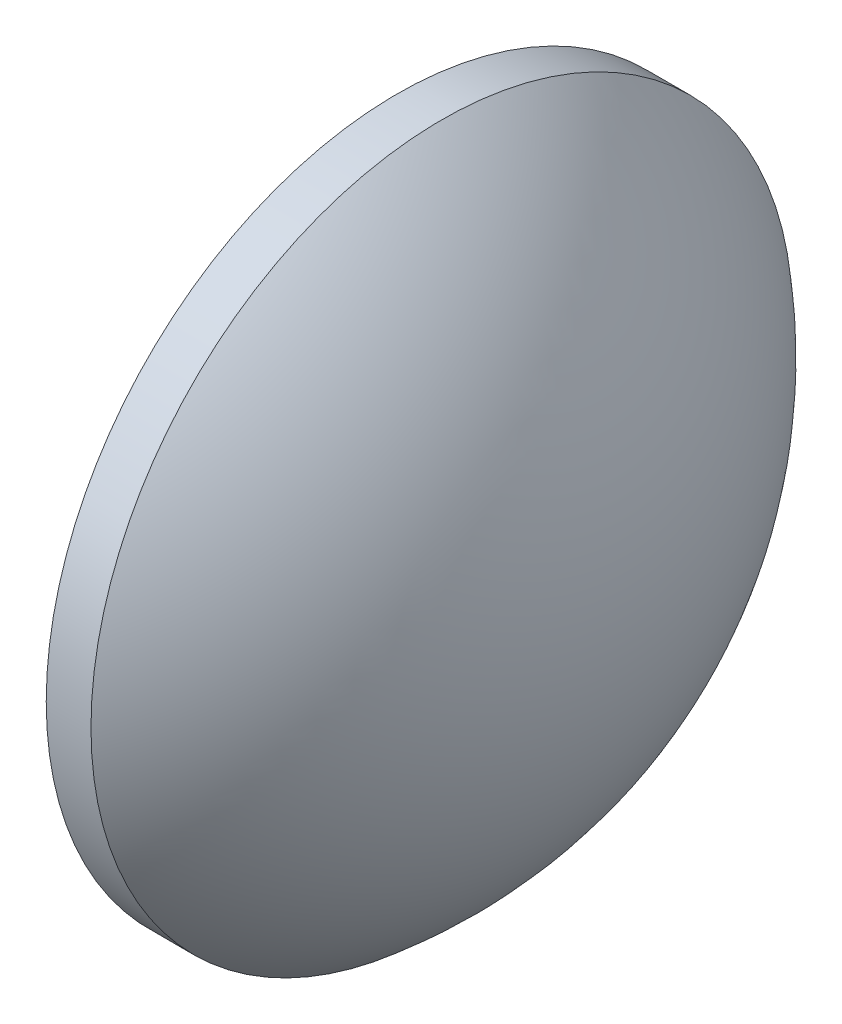
ISO-10303-21;
HEADER;
FILE_DESCRIPTION(('STEP AP214'),'2;1');
FILE_NAME('part.step','',(''),(''),'','','');
FILE_SCHEMA(('AUTOMOTIVE_DESIGN { 1 0 10303 214 1 1 1 1 }'));
ENDSEC;
DATA;
#1=APPLICATION_CONTEXT('core data for automotive mechanical design processes');
#2=APPLICATION_PROTOCOL_DEFINITION('international standard','automotive_design',2000,#1);
#3=PRODUCT_CONTEXT('',#1,'mechanical');
#4=PRODUCT('Part','Part','',(#3));
#5=PRODUCT_RELATED_PRODUCT_CATEGORY('part','',(#4));
#6=PRODUCT_DEFINITION_FORMATION('','',#4);
#7=PRODUCT_DEFINITION_CONTEXT('part definition',#1,'design');
#8=PRODUCT_DEFINITION('design','',#6,#7);
#9=PRODUCT_DEFINITION_SHAPE('','',#8);
#10=(LENGTH_UNIT() NAMED_UNIT(*) SI_UNIT(.MILLI.,.METRE.));
#11=(NAMED_UNIT(*) PLANE_ANGLE_UNIT() SI_UNIT($,.RADIAN.));
#12=(NAMED_UNIT(*) SI_UNIT($,.STERADIAN.) SOLID_ANGLE_UNIT());
#13=UNCERTAINTY_MEASURE_WITH_UNIT(LENGTH_MEASURE(1.E-05),#10,'distance_accuracy_value','');
#14=(GEOMETRIC_REPRESENTATION_CONTEXT(3) GLOBAL_UNCERTAINTY_ASSIGNED_CONTEXT((#13)) GLOBAL_UNIT_ASSIGNED_CONTEXT((#10,
#11,#12)) REPRESENTATION_CONTEXT('',''));
#15=CARTESIAN_POINT('',(0.,0.,0.));
#16=DIRECTION('',(0.,0.,1.));
#17=DIRECTION('',(1.,0.,0.));
#18=AXIS2_PLACEMENT_3D('',#15,#16,#17);
#19=CARTESIAN_POINT('',(371.45656504064,-7.83378524630618,0.));
#20=DIRECTION('',(-1.,0.,0.));
#21=DIRECTION('',(0.,-1.,0.));
#22=AXIS2_PLACEMENT_3D('',#19,#20,#21);
#23=SPHERICAL_SURFACE('',#22,10.3556084656085);
#24=CARTESIAN_POINT('',(378.032173506249,-7.83378524630618,0.));
#25=DIRECTION('',(-1.,0.,0.));
#26=DIRECTION('',(0.,0.,1.));
#27=AXIS2_PLACEMENT_3D('',#24,#25,#26);
#28=CIRCLE('',#27,8.);
#29=CARTESIAN_POINT('',(378.032173506249,-7.83378524630618,8.));
#30=VERTEX_POINT('',#29);
#31=EDGE_CURVE('E10',#30,#30,#28,.T.);
#32=ORIENTED_EDGE('',*,*,#31,.F.);
#33=EDGE_LOOP('',(#32));
#34=FACE_BOUND('',#33,.T.);
#35=ADVANCED_FACE('F35',(#34),#23,.T.);
#36=CARTESIAN_POINT('',(375.364201033257,-7.83378524630618,0.));
#37=DIRECTION('',(-1.,0.,0.));
#38=DIRECTION('',(0.,0.,1.));
#39=AXIS2_PLACEMENT_3D('',#36,#37,#38);
#40=CYLINDRICAL_SURFACE('',#39,8.);
#41=CARTESIAN_POINT('',(377.012173506249,-7.83378524630618,0.));
#42=DIRECTION('',(-1.,0.,0.));
#43=DIRECTION('',(0.,0.,1.));
#44=AXIS2_PLACEMENT_3D('',#41,#42,#43);
#45=CIRCLE('',#44,8.);
#46=CARTESIAN_POINT('',(377.012173506249,-7.83378524630618,8.));
#47=VERTEX_POINT('',#46);
#48=EDGE_CURVE('E41',#47,#47,#45,.T.);
#49=ORIENTED_EDGE('',*,*,#48,.F.);
#50=EDGE_LOOP('',(#49));
#51=FACE_BOUND('',#50,.T.);
#52=ORIENTED_EDGE('',*,*,#31,.T.);
#53=EDGE_LOOP('',(#52));
#54=FACE_BOUND('',#53,.T.);
#55=ADVANCED_FACE('F49',(#51,#54),#40,.T.);
#56=CARTESIAN_POINT('',(377.012173506249,-7.83378524630618,0.));
#57=DIRECTION('',(1.,0.,0.));
#58=DIRECTION('',(0.,0.,-1.));
#59=AXIS2_PLACEMENT_3D('',#56,#57,#58);
#60=PLANE('',#59);
#61=ORIENTED_EDGE('',*,*,#48,.T.);
#62=EDGE_LOOP('',(#61));
#63=FACE_BOUND('',#62,.T.);
#64=ADVANCED_FACE('F47',(#63),#60,.F.);
#65=CLOSED_SHELL('',(#35,#55,#64));
#66=MANIFOLD_SOLID_BREP('B2',#65);
#67=ADVANCED_BREP_SHAPE_REPRESENTATION('',(#18,#66),#14);
#68=SHAPE_DEFINITION_REPRESENTATION(#9,#67);
ENDSEC;
END-ISO-10303-21;
